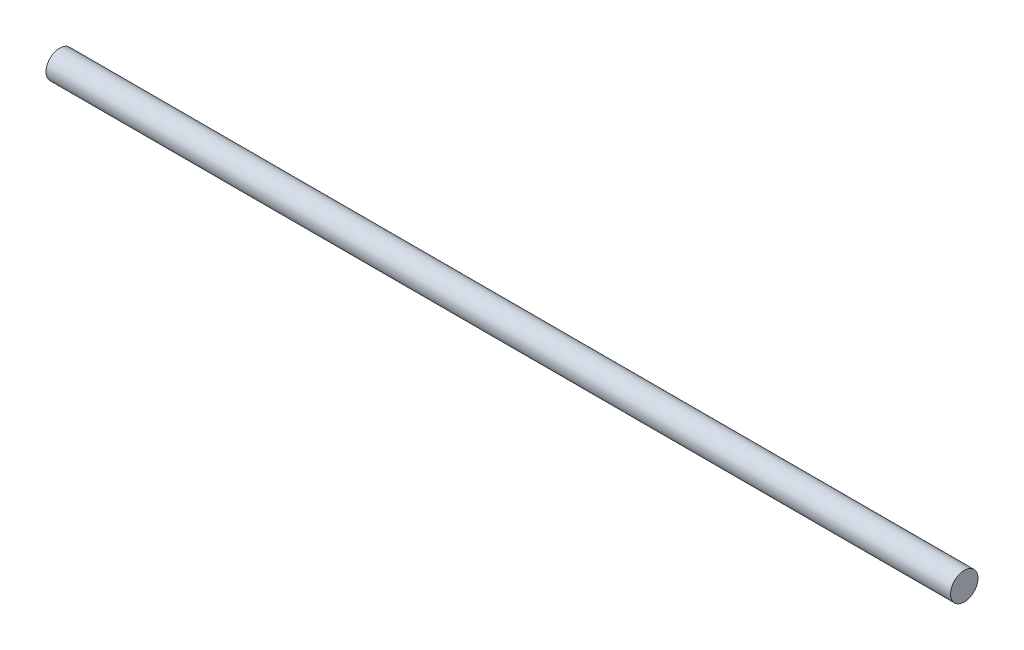
ISO-10303-21;
HEADER;
FILE_DESCRIPTION(('STEP AP214'),'2;1');
FILE_NAME('part.step','',(''),(''),'','','');
FILE_SCHEMA(('AUTOMOTIVE_DESIGN { 1 0 10303 214 1 1 1 1 }'));
ENDSEC;
DATA;
#1=APPLICATION_CONTEXT('core data for automotive mechanical design processes');
#2=APPLICATION_PROTOCOL_DEFINITION('international standard','automotive_design',2000,#1);
#3=PRODUCT_CONTEXT('',#1,'mechanical');
#4=PRODUCT('Part','Part','',(#3));
#5=PRODUCT_RELATED_PRODUCT_CATEGORY('part','',(#4));
#6=PRODUCT_DEFINITION_FORMATION('','',#4);
#7=PRODUCT_DEFINITION_CONTEXT('part definition',#1,'design');
#8=PRODUCT_DEFINITION('design','',#6,#7);
#9=PRODUCT_DEFINITION_SHAPE('','',#8);
#10=(LENGTH_UNIT() NAMED_UNIT(*) SI_UNIT(.MILLI.,.METRE.));
#11=(NAMED_UNIT(*) PLANE_ANGLE_UNIT() SI_UNIT($,.RADIAN.));
#12=(NAMED_UNIT(*) SI_UNIT($,.STERADIAN.) SOLID_ANGLE_UNIT());
#13=UNCERTAINTY_MEASURE_WITH_UNIT(LENGTH_MEASURE(1.E-05),#10,'distance_accuracy_value','');
#14=(GEOMETRIC_REPRESENTATION_CONTEXT(3) GLOBAL_UNCERTAINTY_ASSIGNED_CONTEXT((#13)) GLOBAL_UNIT_ASSIGNED_CONTEXT((#10,
#11,#12)) REPRESENTATION_CONTEXT('',''));
#15=CARTESIAN_POINT('',(0.,0.,0.));
#16=DIRECTION('',(0.,0.,1.));
#17=DIRECTION('',(1.,0.,0.));
#18=AXIS2_PLACEMENT_3D('',#15,#16,#17);
#19=CARTESIAN_POINT('',(355.6,0.,0.));
#20=DIRECTION('',(-1.,0.,0.));
#21=DIRECTION('',(0.,0.,1.));
#22=AXIS2_PLACEMENT_3D('',#19,#20,#21);
#23=CYLINDRICAL_SURFACE('',#22,10.795);
#24=CARTESIAN_POINT('',(355.6,0.,0.));
#25=DIRECTION('',(1.,0.,0.));
#26=DIRECTION('',(0.,0.,-1.));
#27=AXIS2_PLACEMENT_3D('',#24,#25,#26);
#28=CIRCLE('',#27,10.795);
#29=CARTESIAN_POINT('',(355.6,0.,-10.795));
#30=VERTEX_POINT('',#29);
#31=EDGE_CURVE('E10',#30,#30,#28,.T.);
#32=ORIENTED_EDGE('',*,*,#31,.F.);
#33=EDGE_LOOP('',(#32));
#34=FACE_BOUND('',#33,.T.);
#35=CARTESIAN_POINT('',(-355.6,0.,0.));
#36=DIRECTION('',(1.,0.,0.));
#37=DIRECTION('',(0.,0.,-1.));
#38=AXIS2_PLACEMENT_3D('',#35,#36,#37);
#39=CIRCLE('',#38,10.795);
#40=CARTESIAN_POINT('',(-355.6,0.,-10.795));
#41=VERTEX_POINT('',#40);
#42=EDGE_CURVE('E37',#41,#41,#39,.T.);
#43=ORIENTED_EDGE('',*,*,#42,.T.);
#44=EDGE_LOOP('',(#43));
#45=FACE_BOUND('',#44,.T.);
#46=ADVANCED_FACE('F34',(#34,#45),#23,.T.);
#47=CARTESIAN_POINT('',(355.6,0.,0.));
#48=DIRECTION('',(1.,0.,0.));
#49=DIRECTION('',(0.,0.,-1.));
#50=AXIS2_PLACEMENT_3D('',#47,#48,#49);
#51=PLANE('',#50);
#52=ORIENTED_EDGE('',*,*,#31,.T.);
#53=EDGE_LOOP('',(#52));
#54=FACE_BOUND('',#53,.T.);
#55=ADVANCED_FACE('F49',(#54),#51,.T.);
#56=CARTESIAN_POINT('',(-355.6,0.,0.));
#57=DIRECTION('',(1.,0.,0.));
#58=DIRECTION('',(0.,0.,-1.));
#59=AXIS2_PLACEMENT_3D('',#56,#57,#58);
#60=PLANE('',#59);
#61=ORIENTED_EDGE('',*,*,#42,.F.);
#62=EDGE_LOOP('',(#61));
#63=FACE_BOUND('',#62,.T.);
#64=ADVANCED_FACE('F47',(#63),#60,.F.);
#65=CLOSED_SHELL('',(#46,#55,#64));
#66=MANIFOLD_SOLID_BREP('B2',#65);
#67=ADVANCED_BREP_SHAPE_REPRESENTATION('',(#18,#66),#14);
#68=SHAPE_DEFINITION_REPRESENTATION(#9,#67);
ENDSEC;
END-ISO-10303-21;
